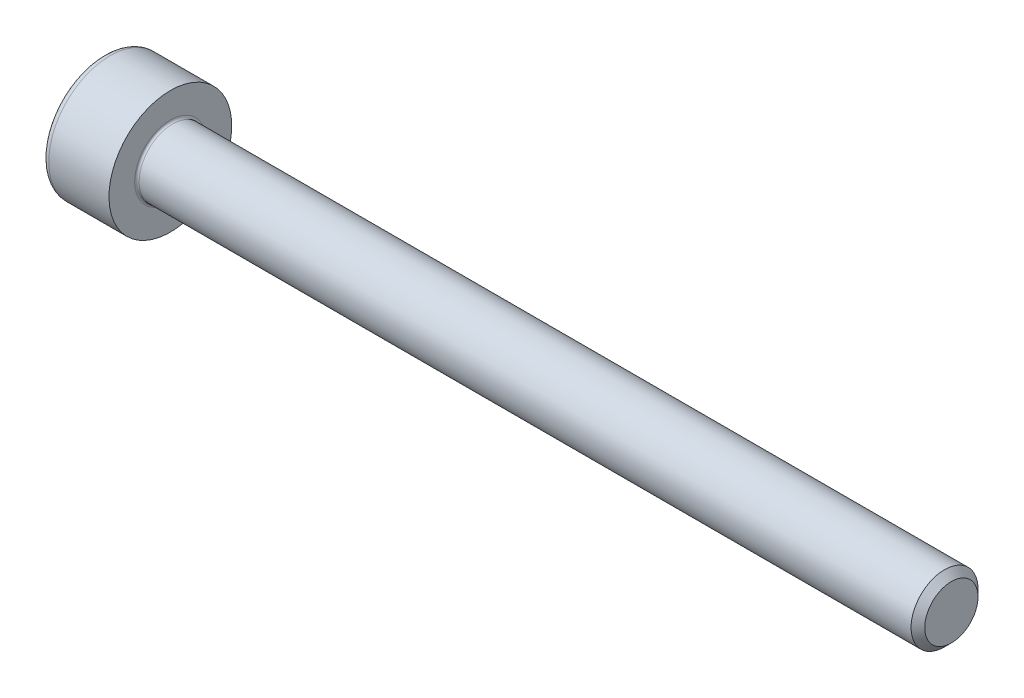
ISO-10303-21;
HEADER;
FILE_DESCRIPTION(('STEP AP214'),'2;1');
FILE_NAME('part.step','',(''),(''),'','','');
FILE_SCHEMA(('AUTOMOTIVE_DESIGN { 1 0 10303 214 1 1 1 1 }'));
ENDSEC;
DATA;
#1=APPLICATION_CONTEXT('core data for automotive mechanical design processes');
#2=APPLICATION_PROTOCOL_DEFINITION('international standard','automotive_design',2000,#1);
#3=PRODUCT_CONTEXT('',#1,'mechanical');
#4=PRODUCT('Part','Part','',(#3));
#5=PRODUCT_RELATED_PRODUCT_CATEGORY('part','',(#4));
#6=PRODUCT_DEFINITION_FORMATION('','',#4);
#7=PRODUCT_DEFINITION_CONTEXT('part definition',#1,'design');
#8=PRODUCT_DEFINITION('design','',#6,#7);
#9=PRODUCT_DEFINITION_SHAPE('','',#8);
#10=(LENGTH_UNIT() NAMED_UNIT(*) SI_UNIT(.MILLI.,.METRE.));
#11=(NAMED_UNIT(*) PLANE_ANGLE_UNIT() SI_UNIT($,.RADIAN.));
#12=(NAMED_UNIT(*) SI_UNIT($,.STERADIAN.) SOLID_ANGLE_UNIT());
#13=UNCERTAINTY_MEASURE_WITH_UNIT(LENGTH_MEASURE(1.E-05),#10,'distance_accuracy_value','');
#14=(GEOMETRIC_REPRESENTATION_CONTEXT(3) GLOBAL_UNCERTAINTY_ASSIGNED_CONTEXT((#13)) GLOBAL_UNIT_ASSIGNED_CONTEXT((#10,
#11,#12)) REPRESENTATION_CONTEXT('',''));
#15=CARTESIAN_POINT('',(0.,0.,0.));
#16=DIRECTION('',(0.,0.,1.));
#17=DIRECTION('',(1.,0.,0.));
#18=AXIS2_PLACEMENT_3D('',#15,#16,#17);
#19=CARTESIAN_POINT('',(0.100000000000002,0.,0.));
#20=DIRECTION('',(1.,0.,0.));
#21=DIRECTION('',(0.,1.,0.));
#22=AXIS2_PLACEMENT_3D('',#19,#20,#21);
#23=TOROIDAL_SURFACE('',#22,1.6,0.1);
#24=CARTESIAN_POINT('',(0.,0.,0.));
#25=DIRECTION('',(1.,0.,0.));
#26=DIRECTION('',(0.,1.,0.));
#27=AXIS2_PLACEMENT_3D('',#24,#25,#26);
#28=CIRCLE('',#27,1.6);
#29=CARTESIAN_POINT('',(0.,1.6,0.));
#30=VERTEX_POINT('',#29);
#31=EDGE_CURVE('E11',#30,#30,#28,.T.);
#32=ORIENTED_EDGE('',*,*,#31,.T.);
#33=EDGE_LOOP('',(#32));
#34=FACE_BOUND('',#33,.T.);
#35=CARTESIAN_POINT('',(0.100000000000002,0.,0.));
#36=DIRECTION('',(-1.,0.,0.));
#37=DIRECTION('',(0.,1.,0.));
#38=AXIS2_PLACEMENT_3D('',#35,#36,#37);
#39=CIRCLE('',#38,1.5);
#40=CARTESIAN_POINT('',(0.100000000000002,1.5,0.));
#41=VERTEX_POINT('',#40);
#42=EDGE_CURVE('E27',#41,#41,#39,.T.);
#43=ORIENTED_EDGE('',*,*,#42,.T.);
#44=EDGE_LOOP('',(#43));
#45=FACE_BOUND('',#44,.T.);
#46=ADVANCED_FACE('F16',(#34,#45),#23,.F.);
#47=CARTESIAN_POINT('',(26.,0.,0.));
#48=DIRECTION('',(1.,0.,0.));
#49=DIRECTION('',(0.,1.,0.));
#50=AXIS2_PLACEMENT_3D('',#47,#48,#49);
#51=CYLINDRICAL_SURFACE('',#50,1.5);
#52=CARTESIAN_POINT('',(34.693275,0.,0.));
#53=DIRECTION('',(1.,0.,0.));
#54=DIRECTION('',(0.,1.,0.));
#55=AXIS2_PLACEMENT_3D('',#52,#53,#54);
#56=CIRCLE('',#55,1.5);
#57=CARTESIAN_POINT('',(34.693275,1.5,0.));
#58=VERTEX_POINT('',#57);
#59=EDGE_CURVE('E161',#58,#58,#56,.T.);
#60=ORIENTED_EDGE('',*,*,#59,.F.);
#61=EDGE_LOOP('',(#60));
#62=FACE_BOUND('',#61,.T.);
#63=ORIENTED_EDGE('',*,*,#42,.F.);
#64=EDGE_LOOP('',(#63));
#65=FACE_BOUND('',#64,.T.);
#66=ADVANCED_FACE('F171',(#62,#65),#51,.T.);
#67=CARTESIAN_POINT('',(0.,2.125,0.));
#68=DIRECTION('',(1.,0.,0.));
#69=DIRECTION('',(0.,1.,0.));
#70=AXIS2_PLACEMENT_3D('',#67,#68,#69);
#71=PLANE('',#70);
#72=CARTESIAN_POINT('',(0.,0.,0.));
#73=DIRECTION('',(1.,0.,0.));
#74=DIRECTION('',(0.,1.,0.));
#75=AXIS2_PLACEMENT_3D('',#72,#73,#74);
#76=CIRCLE('',#75,2.75);
#77=CARTESIAN_POINT('',(0.,2.75,0.));
#78=VERTEX_POINT('',#77);
#79=EDGE_CURVE('E162',#78,#78,#76,.T.);
#80=ORIENTED_EDGE('',*,*,#79,.T.);
#81=EDGE_LOOP('',(#80));
#82=FACE_BOUND('',#81,.T.);
#83=ORIENTED_EDGE('',*,*,#31,.F.);
#84=EDGE_LOOP('',(#83));
#85=FACE_BOUND('',#84,.T.);
#86=ADVANCED_FACE('F173',(#82,#85),#71,.T.);
#87=CARTESIAN_POINT('',(34.8466375,0.,0.));
#88=DIRECTION('',(-1.,0.,0.));
#89=DIRECTION('',(0.,1.,0.));
#90=AXIS2_PLACEMENT_3D('',#87,#88,#89);
#91=CONICAL_SURFACE('',#90,1.3466375,0.785398163397445);
#92=ORIENTED_EDGE('',*,*,#59,.T.);
#93=EDGE_LOOP('',(#92));
#94=FACE_BOUND('',#93,.T.);
#95=CARTESIAN_POINT('',(35.,0.,0.));
#96=DIRECTION('',(-1.,0.,0.));
#97=DIRECTION('',(0.,1.,0.));
#98=AXIS2_PLACEMENT_3D('',#95,#96,#97);
#99=CIRCLE('',#98,1.193275);
#100=CARTESIAN_POINT('',(35.,1.193275,0.));
#101=VERTEX_POINT('',#100);
#102=EDGE_CURVE('E158',#101,#101,#99,.T.);
#103=ORIENTED_EDGE('',*,*,#102,.T.);
#104=EDGE_LOOP('',(#103));
#105=FACE_BOUND('',#104,.T.);
#106=ADVANCED_FACE('F181',(#94,#105),#91,.T.);
#107=CARTESIAN_POINT('',(35.,0.750000000000001,0.));
#108=DIRECTION('',(1.,0.,0.));
#109=DIRECTION('',(0.,1.,0.));
#110=AXIS2_PLACEMENT_3D('',#107,#108,#109);
#111=PLANE('',#110);
#112=ORIENTED_EDGE('',*,*,#102,.F.);
#113=EDGE_LOOP('',(#112));
#114=FACE_BOUND('',#113,.T.);
#115=ADVANCED_FACE('F196',(#114),#111,.T.);
#116=CARTESIAN_POINT('',(-2.69999999999999,0.,0.));
#117=DIRECTION('',(1.,0.,0.));
#118=DIRECTION('',(0.,1.,0.));
#119=AXIS2_PLACEMENT_3D('',#116,#117,#118);
#120=TOROIDAL_SURFACE('',#119,2.45,0.3);
#121=CARTESIAN_POINT('',(-2.99999999999999,0.,0.));
#122=DIRECTION('',(1.,0.,0.));
#123=DIRECTION('',(0.,1.,0.));
#124=AXIS2_PLACEMENT_3D('',#121,#122,#123);
#125=CIRCLE('',#124,2.45);
#126=CARTESIAN_POINT('',(-2.99999999999999,2.45,0.));
#127=VERTEX_POINT('',#126);
#128=EDGE_CURVE('E155',#127,#127,#125,.T.);
#129=ORIENTED_EDGE('',*,*,#128,.T.);
#130=EDGE_LOOP('',(#129));
#131=FACE_BOUND('',#130,.T.);
#132=CARTESIAN_POINT('',(-2.69999999999999,0.,0.));
#133=DIRECTION('',(-1.,0.,0.));
#134=DIRECTION('',(0.,1.,0.));
#135=AXIS2_PLACEMENT_3D('',#132,#133,#134);
#136=CIRCLE('',#135,2.75);
#137=CARTESIAN_POINT('',(-2.69999999999999,2.75,0.));
#138=VERTEX_POINT('',#137);
#139=EDGE_CURVE('E152',#138,#138,#136,.T.);
#140=ORIENTED_EDGE('',*,*,#139,.T.);
#141=EDGE_LOOP('',(#140));
#142=FACE_BOUND('',#141,.T.);
#143=ADVANCED_FACE('F201',(#131,#142),#120,.T.);
#144=CARTESIAN_POINT('',(-2.99999999999999,2.09668783648703,0.));
#145=DIRECTION('',(-1.,0.,0.));
#146=DIRECTION('',(0.,-1.,0.));
#147=AXIS2_PLACEMENT_3D('',#144,#145,#146);
#148=PLANE('',#147);
#149=DIRECTION('',(0.,0.,1.));
#150=VECTOR('',#149,1.);
#151=CARTESIAN_POINT('',(-2.99999999999999,1.25,0.360843918243515));
#152=LINE('',#151,#150);
#153=CARTESIAN_POINT('',(-2.99999999999999,1.25,-0.721687836487033));
#154=VERTEX_POINT('',#153);
#155=CARTESIAN_POINT('',(-2.99999999999999,1.25,0.72168783648703));
#156=VERTEX_POINT('',#155);
#157=EDGE_CURVE('E150',#154,#156,#152,.T.);
#158=ORIENTED_EDGE('',*,*,#157,.T.);
#159=DIRECTION('',(0.,-0.866025403784438,0.500000000000001));
#160=VECTOR('',#159,1.);
#161=CARTESIAN_POINT('',(-2.99999999999999,0.3125,1.26295371385231));
#162=LINE('',#161,#160);
#163=CARTESIAN_POINT('',(-2.99999999999999,0.,1.44337567297406));
#164=VERTEX_POINT('',#163);
#165=EDGE_CURVE('E39',#156,#164,#162,.T.);
#166=ORIENTED_EDGE('',*,*,#165,.T.);
#167=DIRECTION('',(0.,-0.866025403784439,-0.5));
#168=VECTOR('',#167,1.);
#169=CARTESIAN_POINT('',(-2.99999999999999,-0.9375,0.902109795608791));
#170=LINE('',#169,#168);
#171=CARTESIAN_POINT('',(-2.99999999999999,-1.25,0.721687836487033));
#172=VERTEX_POINT('',#171);
#173=EDGE_CURVE('E95',#164,#172,#170,.T.);
#174=ORIENTED_EDGE('',*,*,#173,.T.);
#175=DIRECTION('',(0.,0.,-1.));
#176=VECTOR('',#175,1.);
#177=CARTESIAN_POINT('',(-2.99999999999999,-1.25,-0.360843918243516));
#178=LINE('',#177,#176);
#179=CARTESIAN_POINT('',(-2.99999999999999,-1.25,-0.721687836487032));
#180=VERTEX_POINT('',#179);
#181=EDGE_CURVE('E88',#172,#180,#178,.T.);
#182=ORIENTED_EDGE('',*,*,#181,.T.);
#183=DIRECTION('',(0.,0.866025403784439,-0.5));
#184=VECTOR('',#183,1.);
#185=CARTESIAN_POINT('',(-2.99999999999999,-0.3125,-1.26295371385231));
#186=LINE('',#185,#184);
#187=CARTESIAN_POINT('',(-2.99999999999999,0.,-1.44337567297406));
#188=VERTEX_POINT('',#187);
#189=EDGE_CURVE('E144',#180,#188,#186,.T.);
#190=ORIENTED_EDGE('',*,*,#189,.T.);
#191=DIRECTION('',(0.,0.866025403784439,0.5));
#192=VECTOR('',#191,1.);
#193=CARTESIAN_POINT('',(-2.99999999999999,0.9375,-0.902109795608791));
#194=LINE('',#193,#192);
#195=EDGE_CURVE('E135',#188,#154,#194,.T.);
#196=ORIENTED_EDGE('',*,*,#195,.T.);
#197=EDGE_LOOP('',(#158,#166,#174,#182,#190,#196));
#198=FACE_BOUND('',#197,.T.);
#199=ORIENTED_EDGE('',*,*,#128,.F.);
#200=EDGE_LOOP('',(#199));
#201=FACE_BOUND('',#200,.T.);
#202=ADVANCED_FACE('F193',(#198,#201),#148,.T.);
#203=CARTESIAN_POINT('',(-1.49999999999999,0.,0.));
#204=DIRECTION('',(1.,0.,0.));
#205=DIRECTION('',(0.,1.,0.));
#206=AXIS2_PLACEMENT_3D('',#203,#204,#205);
#207=CYLINDRICAL_SURFACE('',#206,2.75);
#208=ORIENTED_EDGE('',*,*,#79,.F.);
#209=EDGE_LOOP('',(#208));
#210=FACE_BOUND('',#209,.T.);
#211=ORIENTED_EDGE('',*,*,#139,.F.);
#212=EDGE_LOOP('',(#211));
#213=FACE_BOUND('',#212,.T.);
#214=ADVANCED_FACE('F190',(#210,#213),#207,.T.);
#215=CARTESIAN_POINT('',(-2.99999999999999,0.,-1.44337567297406));
#216=DIRECTION('',(0.,-0.5,-0.866025403784439));
#217=DIRECTION('',(0.,0.866025403784439,-0.5));
#218=AXIS2_PLACEMENT_3D('',#215,#216,#217);
#219=PLANE('',#218);
#220=CARTESIAN_POINT('',(-1.49999999999999,0.,-1.44337567297407));
#221=CARTESIAN_POINT('',(-1.29166666666665,-0.625000000000001,-1.08253175473055));
#222=CARTESIAN_POINT('',(-1.49999999999999,-1.25000000000001,-0.721687836487024));
#223=(BOUNDED_CURVE() B_SPLINE_CURVE(2,(#220,#221,#222),.UNSPECIFIED.,.F.,
.F.) B_SPLINE_CURVE_WITH_KNOTS((3,3),(0.,0.146054517259743),
.UNSPECIFIED.) CURVE() GEOMETRIC_REPRESENTATION_ITEM() RATIONAL_B_SPLINE_CURVE((1.,
1.15470053837926,1.)) REPRESENTATION_ITEM(''));
#224=CARTESIAN_POINT('',(-1.49999999999999,0.,-1.44337567297406));
#225=VERTEX_POINT('',#224);
#226=CARTESIAN_POINT('',(-1.49999999999999,-1.25,-0.721687836487032));
#227=VERTEX_POINT('',#226);
#228=EDGE_CURVE('E79',#225,#227,#223,.T.);
#229=ORIENTED_EDGE('',*,*,#228,.F.);
#230=DIRECTION('',(-1.,0.,0.));
#231=VECTOR('',#230,1.);
#232=CARTESIAN_POINT('',(-2.24999999999999,0.,-1.44337567297406));
#233=LINE('',#232,#231);
#234=EDGE_CURVE('E125',#225,#188,#233,.T.);
#235=ORIENTED_EDGE('',*,*,#234,.T.);
#236=ORIENTED_EDGE('',*,*,#189,.F.);
#237=DIRECTION('',(-1.,0.,0.));
#238=VECTOR('',#237,1.);
#239=CARTESIAN_POINT('',(-2.24999999999999,-1.25,-0.721687836487033));
#240=LINE('',#239,#238);
#241=EDGE_CURVE('E91',#227,#180,#240,.T.);
#242=ORIENTED_EDGE('',*,*,#241,.F.);
#243=EDGE_LOOP('',(#229,#235,#236,#242));
#244=FACE_BOUND('',#243,.T.);
#245=ADVANCED_FACE('F192',(#244),#219,.F.);
#246=CARTESIAN_POINT('',(-2.99999999999999,1.25,-0.721687836487033));
#247=DIRECTION('',(0.,0.5,-0.866025403784439));
#248=DIRECTION('',(0.,0.866025403784439,0.5));
#249=AXIS2_PLACEMENT_3D('',#246,#247,#248);
#250=PLANE('',#249);
#251=CARTESIAN_POINT('',(-1.49999999999999,1.25000000000001,-0.721687836487025));
#252=CARTESIAN_POINT('',(-1.29166666666665,0.625,-1.08253175473055));
#253=CARTESIAN_POINT('',(-1.49999999999999,0.,-1.44337567297407));
#254=(BOUNDED_CURVE() B_SPLINE_CURVE(2,(#251,#252,#253),.UNSPECIFIED.,.F.,
.F.) B_SPLINE_CURVE_WITH_KNOTS((3,3),(0.,0.146054517259743),
.UNSPECIFIED.) CURVE() GEOMETRIC_REPRESENTATION_ITEM() RATIONAL_B_SPLINE_CURVE((1.,
1.15470053837926,1.)) REPRESENTATION_ITEM(''));
#255=CARTESIAN_POINT('',(-1.49999999999999,1.25,-0.721687836487035));
#256=VERTEX_POINT('',#255);
#257=EDGE_CURVE('E119',#256,#225,#254,.T.);
#258=ORIENTED_EDGE('',*,*,#257,.F.);
#259=DIRECTION('',(-1.,0.,0.));
#260=VECTOR('',#259,1.);
#261=CARTESIAN_POINT('',(-2.24999999999999,1.25,-0.721687836487034));
#262=LINE('',#261,#260);
#263=EDGE_CURVE('E114',#256,#154,#262,.T.);
#264=ORIENTED_EDGE('',*,*,#263,.T.);
#265=ORIENTED_EDGE('',*,*,#195,.F.);
#266=ORIENTED_EDGE('',*,*,#234,.F.);
#267=EDGE_LOOP('',(#258,#264,#265,#266));
#268=FACE_BOUND('',#267,.T.);
#269=ADVANCED_FACE('F217',(#268),#250,.F.);
#270=CARTESIAN_POINT('',(-2.99999999999999,1.25,0.72168783648703));
#271=DIRECTION('',(0.,1.,0.));
#272=DIRECTION('',(0.,0.,1.));
#273=AXIS2_PLACEMENT_3D('',#270,#271,#272);
#274=PLANE('',#273);
#275=CARTESIAN_POINT('',(-1.49999999999999,1.25,0.721687836487046));
#276=CARTESIAN_POINT('',(-1.29166666666665,1.25,0.));
#277=CARTESIAN_POINT('',(-1.49999999999999,1.25,-0.721687836487049));
#278=(BOUNDED_CURVE() B_SPLINE_CURVE(2,(#275,#276,#277),.UNSPECIFIED.,.F.,
.F.) B_SPLINE_CURVE_WITH_KNOTS((3,3),(0.,0.146054517259743),
.UNSPECIFIED.) CURVE() GEOMETRIC_REPRESENTATION_ITEM() RATIONAL_B_SPLINE_CURVE((1.,
1.15470053837925,1.)) REPRESENTATION_ITEM(''));
#279=CARTESIAN_POINT('',(-1.49999999999999,1.25,0.72168783648703));
#280=VERTEX_POINT('',#279);
#281=EDGE_CURVE('E98',#280,#256,#278,.T.);
#282=ORIENTED_EDGE('',*,*,#281,.F.);
#283=DIRECTION('',(-1.,0.,0.));
#284=VECTOR('',#283,1.);
#285=CARTESIAN_POINT('',(-2.24999999999999,1.25,0.72168783648703));
#286=LINE('',#285,#284);
#287=EDGE_CURVE('E108',#280,#156,#286,.T.);
#288=ORIENTED_EDGE('',*,*,#287,.T.);
#289=ORIENTED_EDGE('',*,*,#157,.F.);
#290=ORIENTED_EDGE('',*,*,#263,.F.);
#291=EDGE_LOOP('',(#282,#288,#289,#290));
#292=FACE_BOUND('',#291,.T.);
#293=ADVANCED_FACE('F221',(#292),#274,.F.);
#294=CARTESIAN_POINT('',(-2.99999999999999,0.,1.44337567297406));
#295=DIRECTION('',(0.,0.500000000000001,0.866025403784438));
#296=DIRECTION('',(0.,-0.866025403784438,0.500000000000001));
#297=AXIS2_PLACEMENT_3D('',#294,#295,#296);
#298=PLANE('',#297);
#299=CARTESIAN_POINT('',(-1.49999999999999,0.,1.44337567297407));
#300=CARTESIAN_POINT('',(-1.29166666666665,0.625,1.08253175473055));
#301=CARTESIAN_POINT('',(-1.49999999999999,1.25000000000002,0.721687836487022));
#302=(BOUNDED_CURVE() B_SPLINE_CURVE(2,(#299,#300,#301),.UNSPECIFIED.,.F.,
.F.) B_SPLINE_CURVE_WITH_KNOTS((3,3),(0.,0.146054517259743),
.UNSPECIFIED.) CURVE() GEOMETRIC_REPRESENTATION_ITEM() RATIONAL_B_SPLINE_CURVE((1.,
1.15470053837926,1.)) REPRESENTATION_ITEM(''));
#303=CARTESIAN_POINT('',(-1.49999999999999,0.,1.44337567297406));
#304=VERTEX_POINT('',#303);
#305=EDGE_CURVE('E96',#304,#280,#302,.T.);
#306=ORIENTED_EDGE('',*,*,#305,.F.);
#307=DIRECTION('',(1.,0.,0.));
#308=VECTOR('',#307,1.);
#309=CARTESIAN_POINT('',(-2.24999999999999,0.,1.44337567297406));
#310=LINE('',#309,#308);
#311=EDGE_CURVE('E92',#164,#304,#310,.T.);
#312=ORIENTED_EDGE('',*,*,#311,.F.);
#313=ORIENTED_EDGE('',*,*,#165,.F.);
#314=ORIENTED_EDGE('',*,*,#287,.F.);
#315=EDGE_LOOP('',(#306,#312,#313,#314));
#316=FACE_BOUND('',#315,.T.);
#317=ADVANCED_FACE('F225',(#316),#298,.F.);
#318=CARTESIAN_POINT('',(-2.99999999999999,-1.25,-0.721687836487032));
#319=DIRECTION('',(0.,-1.,0.));
#320=DIRECTION('',(1.,0.,0.));
#321=AXIS2_PLACEMENT_3D('',#318,#319,#320);
#322=PLANE('',#321);
#323=CARTESIAN_POINT('',(-1.49999999999999,-1.25,-0.721687836487048));
#324=CARTESIAN_POINT('',(-1.29166666666665,-1.25,0.));
#325=CARTESIAN_POINT('',(-1.49999999999999,-1.25,0.721687836487048));
#326=(BOUNDED_CURVE() B_SPLINE_CURVE(2,(#323,#324,#325),.UNSPECIFIED.,.F.,
.F.) B_SPLINE_CURVE_WITH_KNOTS((3,3),(0.,0.146054517259743),
.UNSPECIFIED.) CURVE() GEOMETRIC_REPRESENTATION_ITEM() RATIONAL_B_SPLINE_CURVE((1.,
1.15470053837926,1.)) REPRESENTATION_ITEM(''));
#327=CARTESIAN_POINT('',(-1.49999999999999,-1.25,0.721687836487032));
#328=VERTEX_POINT('',#327);
#329=EDGE_CURVE('E74',#227,#328,#326,.T.);
#330=ORIENTED_EDGE('',*,*,#329,.F.);
#331=ORIENTED_EDGE('',*,*,#241,.T.);
#332=ORIENTED_EDGE('',*,*,#181,.F.);
#333=DIRECTION('',(-1.,0.,0.));
#334=VECTOR('',#333,1.);
#335=CARTESIAN_POINT('',(-2.24999999999999,-1.25,0.721687836487032));
#336=LINE('',#335,#334);
#337=EDGE_CURVE('E85',#328,#172,#336,.T.);
#338=ORIENTED_EDGE('',*,*,#337,.F.);
#339=EDGE_LOOP('',(#330,#331,#332,#338));
#340=FACE_BOUND('',#339,.T.);
#341=ADVANCED_FACE('F86',(#340),#322,.F.);
#342=CARTESIAN_POINT('',(-2.99999999999999,-1.25,0.721687836487033));
#343=DIRECTION('',(0.,-0.5,0.866025403784439));
#344=DIRECTION('',(0.,-0.866025403784439,-0.5));
#345=AXIS2_PLACEMENT_3D('',#342,#343,#344);
#346=PLANE('',#345);
#347=CARTESIAN_POINT('',(-1.49999999999999,-1.25000000000001,0.721687836487025));
#348=CARTESIAN_POINT('',(-1.29166666666665,-0.625,1.08253175473055));
#349=CARTESIAN_POINT('',(-1.49999999999999,0.,1.44337567297407));
#350=(BOUNDED_CURVE() B_SPLINE_CURVE(2,(#347,#348,#349),.UNSPECIFIED.,.F.,
.F.) B_SPLINE_CURVE_WITH_KNOTS((3,3),(0.,0.146054517259743),
.UNSPECIFIED.) CURVE() GEOMETRIC_REPRESENTATION_ITEM() RATIONAL_B_SPLINE_CURVE((1.,
1.15470053837926,1.)) REPRESENTATION_ITEM(''));
#351=EDGE_CURVE('E20',#328,#304,#350,.T.);
#352=ORIENTED_EDGE('',*,*,#351,.F.);
#353=ORIENTED_EDGE('',*,*,#337,.T.);
#354=ORIENTED_EDGE('',*,*,#173,.F.);
#355=ORIENTED_EDGE('',*,*,#311,.T.);
#356=EDGE_LOOP('',(#352,#353,#354,#355));
#357=FACE_BOUND('',#356,.T.);
#358=ADVANCED_FACE('F94',(#357),#346,.F.);
#359=CARTESIAN_POINT('',(-1.08333333333333,0.,0.));
#360=DIRECTION('',(-1.,0.,0.));
#361=DIRECTION('',(0.,1.,0.));
#362=AXIS2_PLACEMENT_3D('',#359,#360,#361);
#363=CONICAL_SURFACE('',#362,0.721687836487032,1.0471975511966);
#364=CARTESIAN_POINT('',(-0.66666666666666,0.,0.));
#365=VERTEX_POINT('',#364);
#366=VERTEX_LOOP('',#365);
#367=FACE_BOUND('',#366,.T.);
#368=ORIENTED_EDGE('',*,*,#305,.T.);
#369=ORIENTED_EDGE('',*,*,#281,.T.);
#370=ORIENTED_EDGE('',*,*,#257,.T.);
#371=ORIENTED_EDGE('',*,*,#228,.T.);
#372=ORIENTED_EDGE('',*,*,#329,.T.);
#373=ORIENTED_EDGE('',*,*,#351,.T.);
#374=EDGE_LOOP('',(#368,#369,#370,#371,#372,#373));
#375=FACE_BOUND('',#374,.T.);
#376=ADVANCED_FACE('F18',(#367,#375),#363,.F.);
#377=CLOSED_SHELL('',(#46,#66,#86,#106,#115,#143,#202,#214,#245,#269,#293,#317,#341,#358,#376));
#378=MANIFOLD_SOLID_BREP('B1',#377);
#379=ADVANCED_BREP_SHAPE_REPRESENTATION('',(#18,#378),#14);
#380=SHAPE_DEFINITION_REPRESENTATION(#9,#379);
ENDSEC;
END-ISO-10303-21;
